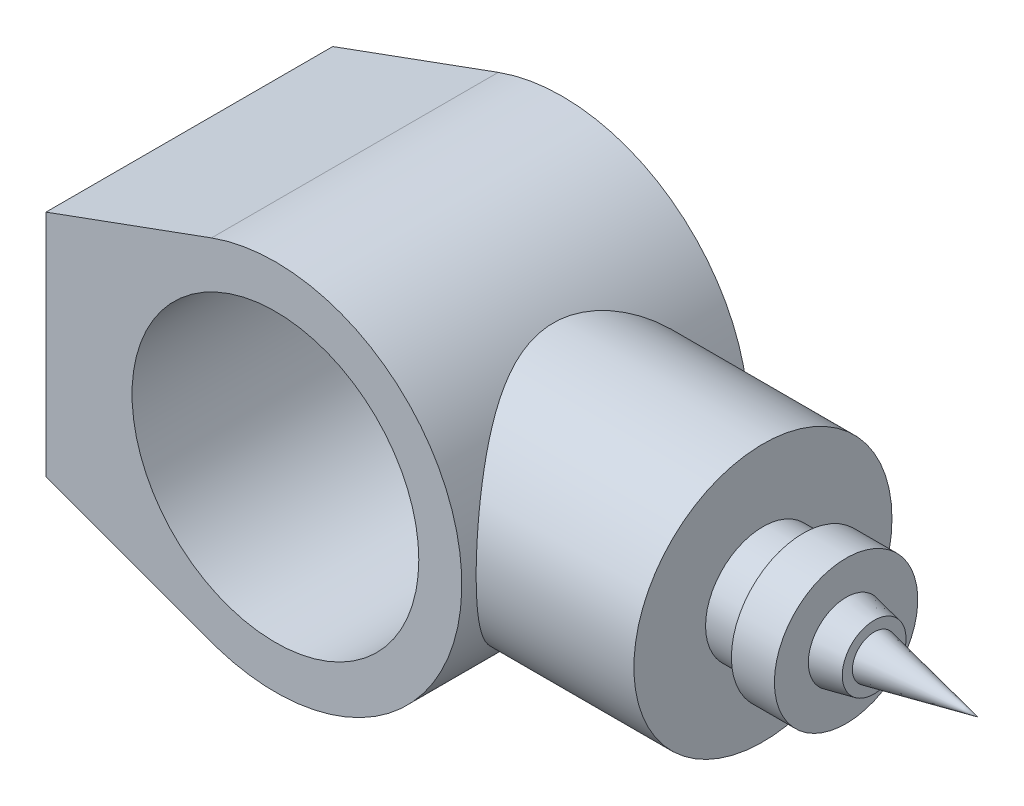
ISO-10303-21;
HEADER;
FILE_DESCRIPTION(('STEP AP214'),'2;1');
FILE_NAME('part.step','',(''),(''),'','','');
FILE_SCHEMA(('AUTOMOTIVE_DESIGN { 1 0 10303 214 1 1 1 1 }'));
ENDSEC;
DATA;
#1=APPLICATION_CONTEXT('core data for automotive mechanical design processes');
#2=APPLICATION_PROTOCOL_DEFINITION('international standard','automotive_design',2000,#1);
#3=PRODUCT_CONTEXT('',#1,'mechanical');
#4=PRODUCT('Part','Part','',(#3));
#5=PRODUCT_RELATED_PRODUCT_CATEGORY('part','',(#4));
#6=PRODUCT_DEFINITION_FORMATION('','',#4);
#7=PRODUCT_DEFINITION_CONTEXT('part definition',#1,'design');
#8=PRODUCT_DEFINITION('design','',#6,#7);
#9=PRODUCT_DEFINITION_SHAPE('','',#8);
#10=(LENGTH_UNIT() NAMED_UNIT(*) SI_UNIT(.MILLI.,.METRE.));
#11=(NAMED_UNIT(*) PLANE_ANGLE_UNIT() SI_UNIT($,.RADIAN.));
#12=(NAMED_UNIT(*) SI_UNIT($,.STERADIAN.) SOLID_ANGLE_UNIT());
#13=UNCERTAINTY_MEASURE_WITH_UNIT(LENGTH_MEASURE(1.E-05),#10,'distance_accuracy_value','');
#14=(GEOMETRIC_REPRESENTATION_CONTEXT(3) GLOBAL_UNCERTAINTY_ASSIGNED_CONTEXT((#13)) GLOBAL_UNIT_ASSIGNED_CONTEXT((#10,
#11,#12)) REPRESENTATION_CONTEXT('',''));
#15=CARTESIAN_POINT('',(0.,0.,0.));
#16=DIRECTION('',(0.,0.,1.));
#17=DIRECTION('',(1.,0.,0.));
#18=AXIS2_PLACEMENT_3D('',#15,#16,#17);
#19=CARTESIAN_POINT('',(0.,0.,50.));
#20=DIRECTION('',(0.,0.,-1.));
#21=DIRECTION('',(-1.,0.,0.));
#22=AXIS2_PLACEMENT_3D('',#19,#20,#21);
#23=CYLINDRICAL_SURFACE('',#22,65.);
#24=CARTESIAN_POINT('',(65.,0.,-45.));
#25=CARTESIAN_POINT('',(65.0000011696057,1.12147330120565,-45.0000012025283));
#26=CARTESIAN_POINT('',(64.9709159765212,2.24292945230778,-44.9580201602482));
#27=CARTESIAN_POINT('',(64.8553068641383,4.47658414079082,-44.790785609369));
#28=CARTESIAN_POINT('',(64.7687842573088,5.58878288911931,-44.6655340035371));
#29=CARTESIAN_POINT('',(64.5403785763001,7.79555151848628,-44.3336771879691));
#30=CARTESIAN_POINT('',(64.3984760503456,8.89011506447751,-44.1270433931238));
#31=CARTESIAN_POINT('',(64.0626457436966,11.0533096019768,-43.6354760134034));
#32=CARTESIAN_POINT('',(63.8687169569864,12.1219400915896,-43.3505409144375));
#33=CARTESIAN_POINT('',(63.4342222744662,14.2212125160505,-42.7078017297046));
#34=CARTESIAN_POINT('',(63.1938918545645,15.2520162370063,-42.3503651251477));
#35=CARTESIAN_POINT('',(62.6709259446924,17.2756280115286,-41.5659763086892));
#36=CARTESIAN_POINT('',(62.3882907364915,18.268436318107,-41.1390245597888));
#37=CARTESIAN_POINT('',(61.786108553932,20.2116697228795,-40.2199419970838));
#38=CARTESIAN_POINT('',(61.4665619062631,21.1620951960855,-39.7278117601444));
#39=CARTESIAN_POINT('',(60.7962171584065,23.0172309124314,-38.6825647509799));
#40=CARTESIAN_POINT('',(60.4454175300334,23.9219389167185,-38.1294449962195));
#41=CARTESIAN_POINT('',(59.6865648974474,25.7601880140228,-36.9151737617935));
#42=CARTESIAN_POINT('',(59.27618815402,26.6893215363404,-36.2488040005491));
#43=CARTESIAN_POINT('',(58.4330275057249,28.4880338622967,-34.8529502059224));
#44=CARTESIAN_POINT('',(58.0002425478181,29.3576098626539,-34.1234632053608));
#45=CARTESIAN_POINT('',(57.1195111836477,31.0364486388513,-32.6040251352403));
#46=CARTESIAN_POINT('',(56.6715447181891,31.8456267033451,-31.8139921794123));
#47=CARTESIAN_POINT('',(55.7691986061138,33.4006700551814,-30.1773036556993));
#48=CARTESIAN_POINT('',(55.3148185876119,34.1465316534289,-29.3306447936721));
#49=CARTESIAN_POINT('',(54.3303114345595,35.6959084068904,-27.4326466159468));
#50=CARTESIAN_POINT('',(53.8005937511269,36.4872853280241,-26.3711450656527));
#51=CARTESIAN_POINT('',(52.7593327891933,37.9773509509911,-24.17604025639));
#52=CARTESIAN_POINT('',(52.2477941160227,38.6760162868262,-23.0424189272517));
#53=CARTESIAN_POINT('',(51.2608149265043,39.9749077721744,-20.7072341856928));
#54=CARTESIAN_POINT('',(50.7853275075273,40.5752630453964,-19.5057627267967));
#55=CARTESIAN_POINT('',(49.8892399163793,41.6721166930025,-17.036931864064));
#56=CARTESIAN_POINT('',(49.4686114171658,42.1686687478853,-15.7696069409943));
#57=CARTESIAN_POINT('',(48.8208029416879,42.9149535309565,-13.5723996352816));
#58=CARTESIAN_POINT('',(48.5738420263557,43.1936925213245,-12.6581208440976));
#59=CARTESIAN_POINT('',(48.1238801744123,43.6944569649788,-10.8035389223551));
#60=CARTESIAN_POINT('',(47.9208721021929,43.9164916250901,-9.86324004407419));
#61=CARTESIAN_POINT('',(47.5660754926548,44.3005296261305,-7.96250438663409));
#62=CARTESIAN_POINT('',(47.4142038087044,44.4626304606427,-7.00210302149487));
#63=CARTESIAN_POINT('',(47.1671263845177,44.7246555122386,-5.06554052628518));
#64=CARTESIAN_POINT('',(47.0719206259529,44.824579749433,-4.08937940131224));
#65=CARTESIAN_POINT('',(46.9418899090943,44.9607388198673,-2.1232364847967));
#66=CARTESIAN_POINT('',(46.9073939345417,44.9966266570423,-1.13320851844658));
#67=CARTESIAN_POINT('',(46.9013571135476,45.0029190462422,0.847248377093852));
#68=CARTESIAN_POINT('',(46.9298161498631,44.9733237202183,1.837677305534));
#69=CARTESIAN_POINT('',(47.0484302849821,44.8492190899201,3.81128752429081));
#70=CARTESIAN_POINT('',(47.13862305521,44.7546701492421,4.79446401850661));
#71=CARTESIAN_POINT('',(47.3768313176079,44.5024241630868,6.74551496467455));
#72=CARTESIAN_POINT('',(47.5248480621437,44.3447257499009,7.71338908473168));
#73=CARTESIAN_POINT('',(47.8621764271841,43.9803320764262,9.56919366964684));
#74=CARTESIAN_POINT('',(48.0484149088864,43.7772163066585,10.4583970625519));
#75=CARTESIAN_POINT('',(48.4609441046406,43.32010640119,12.2144143492181));
#76=CARTESIAN_POINT('',(48.6872496045115,43.0660934784815,13.0812198417583));
#77=CARTESIAN_POINT('',(49.1738509640383,42.5096331932465,14.7898225666927));
#78=CARTESIAN_POINT('',(49.4341648638834,42.2071601049958,15.6316062329481));
#79=CARTESIAN_POINT('',(49.9825182796335,41.5563350032134,17.2876417419013));
#80=CARTESIAN_POINT('',(50.2705534011697,41.2079902580444,18.1018979206949));
#81=CARTESIAN_POINT('',(51.0225431471345,40.2767822129268,20.1137766396802));
#82=CARTESIAN_POINT('',(51.5007434523328,39.6654891440572,21.2930273345177));
#83=CARTESIAN_POINT('',(52.4891158781477,38.348029920852,23.5833678403921));
#84=CARTESIAN_POINT('',(52.9993005340589,37.6418264436726,24.6944305853524));
#85=CARTESIAN_POINT('',(54.0361557973494,36.1376496350166,26.8476775780095));
#86=CARTESIAN_POINT('',(54.5628535785461,35.3395185623559,27.8897384505711));
#87=CARTESIAN_POINT('',(55.6171804467178,33.6558443419671,29.8998791095632));
#88=CARTESIAN_POINT('',(56.1448094104418,32.7703120184234,30.8679680307498));
#89=CARTESIAN_POINT('',(57.1932449701135,30.9045304086319,32.7363921475659));
#90=CARTESIAN_POINT('',(57.7139191350983,29.9233731295192,33.6358963165067));
#91=CARTESIAN_POINT('',(58.7296419536465,27.8771206485979,35.350355349792));
#92=CARTESIAN_POINT('',(59.2246882700661,26.8120178135979,36.1653025097018));
#93=CARTESIAN_POINT('',(60.1756566955639,24.6035209522421,37.7024332048813));
#94=CARTESIAN_POINT('',(60.6316475651595,23.4602711709794,38.4247809320632));
#95=CARTESIAN_POINT('',(61.4931891608211,21.0989507187335,39.7703323765769));
#96=CARTESIAN_POINT('',(61.898755017873,19.8809026570889,40.3935658507715));
#97=CARTESIAN_POINT('',(62.5646802947783,17.6549035875762,41.4059204565395));
#98=CARTESIAN_POINT('',(62.8372982548467,16.6602403417733,41.8163120535009));
#99=CARTESIAN_POINT('',(63.3397164077328,14.6345031625144,42.5675669112335));
#100=CARTESIAN_POINT('',(63.569522535998,13.603434299959,42.9084398107234));
#101=CARTESIAN_POINT('',(63.9815049902596,11.5110112910016,43.5164676119118));
#102=CARTESIAN_POINT('',(64.1637052650743,10.4496726714621,43.7836595836378));
#103=CARTESIAN_POINT('',(64.476639865795,8.30296993183371,44.2409869387356));
#104=CARTESIAN_POINT('',(64.6073730982257,7.21760530180254,44.431120684921));
#105=CARTESIAN_POINT('',(64.8147345736682,5.02649787175023,44.7321113931983));
#106=CARTESIAN_POINT('',(64.8911534961694,3.92069290489763,44.8426616714377));
#107=CARTESIAN_POINT('',(64.9872183357685,1.70145350776208,44.981563734156));
#108=CARTESIAN_POINT('',(65.0068642771874,0.588019080747696,45.0099155538474));
#109=CARTESIAN_POINT('',(64.9889001241945,-1.63741781931566,44.9839662509349));
#110=CARTESIAN_POINT('',(64.9512898349751,-2.74942028747967,44.929664847113));
#111=CARTESIAN_POINT('',(64.819734418053,-4.96298947367603,44.7392747901952));
#112=CARTESIAN_POINT('',(64.7257910494465,-6.06455651648127,44.6031886909653));
#113=CARTESIAN_POINT('',(64.491175703309,-8.18254449212149,44.2620157992034));
#114=CARTESIAN_POINT('',(64.3536808680178,-9.20007959997774,44.0616107864454));
#115=CARTESIAN_POINT('',(64.0337856060908,-11.2121337136589,43.5930613516679));
#116=CARTESIAN_POINT('',(63.8513873855499,-12.2066538475799,43.3249202574929));
#117=CARTESIAN_POINT('',(63.4451725249075,-14.1673074608523,42.7239854011605));
#118=CARTESIAN_POINT('',(63.2213525684632,-15.1334386601223,42.3911864622047));
#119=CARTESIAN_POINT('',(62.736336352677,-17.0327019487273,41.6643868113868));
#120=CARTESIAN_POINT('',(62.4751380044848,-17.965832190203,41.2703826790343));
#121=CARTESIAN_POINT('',(61.8990085085122,-19.8637431772395,40.3931275129008));
#122=CARTESIAN_POINT('',(61.5815209528501,-20.8256806929253,39.9054081529014));
#123=CARTESIAN_POINT('',(60.9142086391395,-22.7035764997345,38.8677076181211));
#124=CARTESIAN_POINT('',(60.5643826081083,-23.6195329786528,38.3177239921568));
#125=CARTESIAN_POINT('',(59.8381347129401,-25.4032558353403,37.1592008079418));
#126=CARTESIAN_POINT('',(59.4616987975441,-26.270996314329,36.5506302507532));
#127=CARTESIAN_POINT('',(58.6884577670336,-27.9557544991496,35.2787474176625));
#128=CARTESIAN_POINT('',(58.2916515549571,-28.7727694681138,34.6154321925309));
#129=CARTESIAN_POINT('',(57.4151711853793,-30.4889708749912,33.1199200847161));
#130=CARTESIAN_POINT('',(56.9328754552547,-31.3785212006928,32.2781812569548));
#131=CARTESIAN_POINT('',(55.9590893109094,-33.0839042215169,30.5278352445589));
#132=CARTESIAN_POINT('',(55.4675975421249,-33.8997259516808,29.6192181500899));
#133=CARTESIAN_POINT('',(54.4860350387397,-35.45586994741,27.7375714933993));
#134=CARTESIAN_POINT('',(53.9959654596117,-36.1961418986443,26.7644997080007));
#135=CARTESIAN_POINT('',(53.0294834997435,-37.5978502361011,24.7568233036382));
#136=CARTESIAN_POINT('',(52.553069328415,-38.2592969946585,23.7222268074148));
#137=CARTESIAN_POINT('',(51.679941347726,-39.4291013564639,21.7149007388747));
#138=CARTESIAN_POINT('',(51.2803372484816,-39.9463152685162,20.7485884228094));
#139=CARTESIAN_POINT('',(50.5123974548912,-40.9130636661729,18.7705314851885));
#140=CARTESIAN_POINT('',(50.1440619804653,-41.3625976757848,17.7587865441704));
#141=CARTESIAN_POINT('',(49.4504928922364,-42.1893301292689,15.693797265063));
#142=CARTESIAN_POINT('',(49.1251906412473,-42.566644202947,14.6406225749502));
#143=CARTESIAN_POINT('',(48.5290098021012,-43.2451098617227,12.4950157035289));
#144=CARTESIAN_POINT('',(48.2581179989952,-43.5462799449171,11.4025931307277));
#145=CARTESIAN_POINT('',(47.8271610412375,-44.0186874861181,9.3921629994351));
#146=CARTESIAN_POINT('',(47.6558419905218,-44.2036946073207,8.47979353570419));
#147=CARTESIAN_POINT('',(47.3627606953031,-44.517583244497,6.63757582668245));
#148=CARTESIAN_POINT('',(47.2409923142224,-44.6464717105955,5.70772976070373));
#149=CARTESIAN_POINT('',(47.05166615705,-44.8459556683364,3.83718735816971));
#150=CARTESIAN_POINT('',(46.9840561376509,-44.9166073394187,2.89650236820514));
#151=CARTESIAN_POINT('',(46.9055698265682,-44.9985645522097,1.01014116515035));
#152=CARTESIAN_POINT('',(46.894694331428,-45.0098692606967,0.0644648821697862));
#153=CARTESIAN_POINT('',(46.9301408777119,-44.972908524549,-1.82506201386804));
#154=CARTESIAN_POINT('',(46.9764888551696,-44.9246160680299,-2.76891160474201));
#155=CARTESIAN_POINT('',(47.1245232303033,-44.7693052695385,-4.64731891289862));
#156=CARTESIAN_POINT('',(47.226209296244,-44.6622872796082,-5.58187668584874));
#157=CARTESIAN_POINT('',(47.4811423262629,-44.3911660407895,-7.43666598606561));
#158=CARTESIAN_POINT('',(47.634452919394,-44.2269923369625,-8.35687836049678));
#159=CARTESIAN_POINT('',(47.9871889035597,-43.8440109221367,-10.1768310643423));
#160=CARTESIAN_POINT('',(48.1866204648689,-43.6251959006593,-11.0765686368372));
#161=CARTESIAN_POINT('',(48.6908782922366,-43.0625185245671,-13.116726178063));
#162=CARTESIAN_POINT('',(49.0093972350599,-42.7008255731353,-14.2488681052183));
#163=CARTESIAN_POINT('',(49.699554494161,-41.8955268796886,-16.4668795226373));
#164=CARTESIAN_POINT('',(50.0712093704162,-41.4518955887103,-17.5527344499461));
#165=CARTESIAN_POINT('',(50.8544123719762,-40.4872212981013,-19.6760329984318));
#166=CARTESIAN_POINT('',(51.2660067549033,-39.9660881554129,-20.7134183727638));
#167=CARTESIAN_POINT('',(52.116211879306,-38.8508952329155,-22.7363587217865));
#168=CARTESIAN_POINT('',(52.5548209260535,-38.2568400254561,-23.7219169406072));
#169=CARTESIAN_POINT('',(53.4579357785502,-36.9847423381263,-25.6613286822633));
#170=CARTESIAN_POINT('',(53.9228021101371,-36.3051118639051,-26.6139712103077));
#171=CARTESIAN_POINT('',(54.8583333343946,-34.8753950985048,-28.4617532840731));
#172=CARTESIAN_POINT('',(55.3289982185488,-34.1253089107936,-29.3568929142368));
#173=CARTESIAN_POINT('',(56.2664339133503,-32.5564691651912,-31.0876310121466));
#174=CARTESIAN_POINT('',(56.7332035093429,-31.7376950080829,-31.923211478402));
#175=CARTESIAN_POINT('',(57.6535165855435,-30.033481652025,-33.5315189390535));
#176=CARTESIAN_POINT('',(58.1070588196762,-29.1480362003111,-34.3042400240121));
#177=CARTESIAN_POINT('',(59.0635284336244,-27.1643113596245,-35.9022819462667));
#178=CARTESIAN_POINT('',(59.5626106290919,-26.0547472869609,-36.7159606163356));
#179=CARTESIAN_POINT('',(60.5176757229357,-23.7521280348398,-38.2458641369291));
#180=CARTESIAN_POINT('',(60.9736519283074,-22.5590599397198,-38.962073861155));
#181=CARTESIAN_POINT('',(61.6149926579414,-20.7127348127311,-39.9558623322098));
#182=CARTESIAN_POINT('',(61.8215919655179,-20.088110583999,-40.2735888165198));
#183=CARTESIAN_POINT('',(62.2191547005856,-18.8206694867556,-40.8812436548858));
#184=CARTESIAN_POINT('',(62.4101203779565,-18.1778552539997,-41.1711760099034));
#185=CARTESIAN_POINT('',(62.7748527233683,-16.875283117665,-41.7219931318356));
#186=CARTESIAN_POINT('',(62.9486230408552,-16.2155288469421,-41.9828840638124));
#187=CARTESIAN_POINT('',(63.2775356475737,-14.8804011558233,-42.4744610119283));
#188=CARTESIAN_POINT('',(63.432679284421,-14.2050288695917,-42.7051492133046));
#189=CARTESIAN_POINT('',(63.8070721968101,-12.4447010544915,-43.25974494481));
#190=CARTESIAN_POINT('',(64.0114184468014,-11.3490405228654,-43.5602757498286));
#191=CARTESIAN_POINT('',(64.3654191982087,-9.12991345978806,-44.078827644396));
#192=CARTESIAN_POINT('',(64.5150820049425,-8.00645117856259,-44.2968612637911));
#193=CARTESIAN_POINT('',(64.7559993187061,-5.74082253729113,-44.6470112993716));
#194=CARTESIAN_POINT('',(64.847297757104,-4.59867091062173,-44.7791923387443));
#195=CARTESIAN_POINT('',(64.9692976296881,-2.30434018473195,-44.9556862638234));
#196=CARTESIAN_POINT('',(64.9999987983895,-1.15216104160189,-44.999998764566));
#197=CARTESIAN_POINT('',(65.,0.,-45.));
#198=B_SPLINE_CURVE_WITH_KNOTS('',3,(#24,#25,#26,#27,#28,#29,#30,#31,#32,#33,#34,#35,#36,#37,
#38,#39,#40,#41,#42,#43,#44,#45,#46,#47,#48,#49,#50,#51,#52,#53,#54,#55,#56,#57,#58,#59,#60,#61,
#62,#63,#64,#65,#66,#67,#68,#69,#70,#71,#72,#73,#74,#75,#76,#77,#78,#79,#80,#81,#82,#83,#84,#85,
#86,#87,#88,#89,#90,#91,#92,#93,#94,#95,#96,#97,#98,#99,#100,#101,#102,#103,#104,#105,#106,#107,
#108,#109,#110,#111,#112,#113,#114,#115,#116,#117,#118,#119,#120,#121,#122,#123,#124,#125,#126,
#127,#128,#129,#130,#131,#132,#133,#134,#135,#136,#137,#138,#139,#140,#141,#142,#143,#144,#145,
#146,#147,#148,#149,#150,#151,#152,#153,#154,#155,#156,#157,#158,#159,#160,#161,#162,#163,#164,
#165,#166,#167,#168,#169,#170,#171,#172,#173,#174,#175,#176,#177,#178,#179,#180,#181,#182,#183,
#184,#185,#186,#187,#188,#189,#190,#191,#192,#193,#194,#195,#196,#197),.UNSPECIFIED.,.T.,.F.,(4,
2,2,2,2,2,2,2,2,2,2,2,2,2,2,2,2,2,2,2,2,2,2,2,2,2,2,2,2,2,2,2,2,2,2,2,2,2,2,2,2,2,2,2,2,2,2,2,2,
2,2,2,2,2,2,2,2,2,2,2,2,2,2,2,2,2,2,2,2,2,2,2,2,2,2,2,2,2,2,2,2,2,2,2,2,2,4),(0.,
3.36323892794144,6.72640100710137,10.0907454360665,13.4551549250109,16.8029195613731,
20.1506619010729,23.4983746134034,26.8462511096753,30.4871649037346,34.1282499524345,
37.7743494260164,41.4206611917409,45.6939383064405,49.9682903731881,54.2369825353392,
58.5034617073671,61.4625138492405,64.4210852373372,67.3748225577202,70.3285589227263,
73.2982527376573,76.2679410220407,79.2394430998938,82.2110095388412,85.0011411726389,
87.7923045951578,90.584954683776,93.3771628083065,97.6064034875675,101.837312178738,
106.075592113262,110.313347816192,114.596218662803,118.879479402292,123.155037051935,
127.429308626693,130.755998382163,134.082226580387,137.406778235214,140.731400520075,
144.068767009318,147.406132068879,150.743508483461,154.080780688207,157.215791533369,
160.350648386749,163.485756334407,166.621039552604,169.990545063149,173.360183268584,
176.73161428665,180.103227050672,184.047902440152,187.993163521895,191.94103513809,
195.888386692538,199.385185586645,202.88200907258,206.373186157811,209.863514294626,
212.700365177753,215.536864625513,218.370624567028,221.204424293963,224.039508887241,
226.874576485218,229.713151272815,232.55210603787,236.23803941247,239.925124033801,
243.616531168718,247.307706963636,251.081871120678,254.856029735252,258.631324277359,
262.406973327354,266.792058434818,271.177823293658,273.368885604935,275.55963203795,
277.749912517597,279.940034437727,283.398420446896,286.856280978073,290.31153567335,
293.766805506531),.UNSPECIFIED.);
#199=CARTESIAN_POINT('',(65.,0.,-45.));
#200=VERTEX_POINT('',#199);
#201=EDGE_CURVE('E59',#200,#200,#198,.T.);
#202=ORIENTED_EDGE('',*,*,#201,.F.);
#203=EDGE_LOOP('',(#202));
#204=FACE_BOUND('',#203,.T.);
#205=ADVANCED_FACE('F54',(#204),#23,.F.);
#206=CARTESIAN_POINT('',(120.,0.,0.));
#207=DIRECTION('',(1.,0.,0.));
#208=DIRECTION('',(0.,0.,-1.));
#209=AXIS2_PLACEMENT_3D('',#206,#207,#208);
#210=PLANE('',#209);
#211=CARTESIAN_POINT('',(120.,0.,0.));
#212=DIRECTION('',(-1.,0.,0.));
#213=DIRECTION('',(0.,0.,1.));
#214=AXIS2_PLACEMENT_3D('',#211,#212,#213);
#215=CIRCLE('',#214,20.);
#216=CARTESIAN_POINT('',(120.,0.,20.));
#217=VERTEX_POINT('',#216);
#218=EDGE_CURVE('E94',#217,#217,#215,.T.);
#219=ORIENTED_EDGE('',*,*,#218,.T.);
#220=EDGE_LOOP('',(#219));
#221=FACE_BOUND('',#220,.T.);
#222=CARTESIAN_POINT('',(120.,0.,0.));
#223=DIRECTION('',(1.,0.,0.));
#224=DIRECTION('',(0.,0.,-1.));
#225=AXIS2_PLACEMENT_3D('',#222,#223,#224);
#226=CIRCLE('',#225,45.);
#227=CARTESIAN_POINT('',(120.,0.,-45.));
#228=VERTEX_POINT('',#227);
#229=EDGE_CURVE('E12',#228,#228,#226,.T.);
#230=ORIENTED_EDGE('',*,*,#229,.T.);
#231=EDGE_LOOP('',(#230));
#232=FACE_BOUND('',#231,.T.);
#233=ADVANCED_FACE('F103',(#221,#232),#210,.T.);
#234=CARTESIAN_POINT('',(-80.002,0.,0.));
#235=DIRECTION('',(1.,0.,0.));
#236=DIRECTION('',(0.,0.,-1.));
#237=AXIS2_PLACEMENT_3D('',#234,#235,#236);
#238=CYLINDRICAL_SURFACE('',#237,45.);
#239=ORIENTED_EDGE('',*,*,#229,.F.);
#240=EDGE_LOOP('',(#239));
#241=FACE_BOUND('',#240,.T.);
#242=ORIENTED_EDGE('',*,*,#201,.T.);
#243=EDGE_LOOP('',(#242));
#244=FACE_BOUND('',#243,.T.);
#245=ADVANCED_FACE('F56',(#241,#244),#238,.T.);
#246=CARTESIAN_POINT('',(0.,0.,0.));
#247=DIRECTION('',(-1.,0.,0.));
#248=DIRECTION('',(0.,0.,1.));
#249=AXIS2_PLACEMENT_3D('',#246,#247,#248);
#250=CYLINDRICAL_SURFACE('',#249,20.);
#251=CARTESIAN_POINT('',(134.,0.,0.));
#252=DIRECTION('',(-1.,0.,0.));
#253=DIRECTION('',(0.,0.,1.));
#254=AXIS2_PLACEMENT_3D('',#251,#252,#253);
#255=CIRCLE('',#254,20.);
#256=CARTESIAN_POINT('',(134.,0.,20.));
#257=VERTEX_POINT('',#256);
#258=EDGE_CURVE('E91',#257,#257,#255,.T.);
#259=ORIENTED_EDGE('',*,*,#258,.T.);
#260=EDGE_LOOP('',(#259));
#261=FACE_BOUND('',#260,.T.);
#262=ORIENTED_EDGE('',*,*,#218,.F.);
#263=EDGE_LOOP('',(#262));
#264=FACE_BOUND('',#263,.T.);
#265=ADVANCED_FACE('F110',(#261,#264),#250,.T.);
#266=CARTESIAN_POINT('',(134.,-20.,0.));
#267=DIRECTION('',(-1.,0.,0.));
#268=DIRECTION('',(0.,0.,1.));
#269=AXIS2_PLACEMENT_3D('',#266,#267,#268);
#270=PLANE('',#269);
#271=CARTESIAN_POINT('',(134.,0.,0.));
#272=DIRECTION('',(-1.,0.,0.));
#273=DIRECTION('',(0.,0.,1.));
#274=AXIS2_PLACEMENT_3D('',#271,#272,#273);
#275=CIRCLE('',#274,25.);
#276=CARTESIAN_POINT('',(134.,0.,25.));
#277=VERTEX_POINT('',#276);
#278=EDGE_CURVE('E88',#277,#277,#275,.T.);
#279=ORIENTED_EDGE('',*,*,#278,.T.);
#280=EDGE_LOOP('',(#279));
#281=FACE_BOUND('',#280,.T.);
#282=ORIENTED_EDGE('',*,*,#258,.F.);
#283=EDGE_LOOP('',(#282));
#284=FACE_BOUND('',#283,.T.);
#285=ADVANCED_FACE('F113',(#281,#284),#270,.T.);
#286=CARTESIAN_POINT('',(0.,0.,0.));
#287=DIRECTION('',(-1.,0.,0.));
#288=DIRECTION('',(0.,0.,1.));
#289=AXIS2_PLACEMENT_3D('',#286,#287,#288);
#290=CYLINDRICAL_SURFACE('',#289,25.);
#291=CARTESIAN_POINT('',(149.,0.,0.));
#292=DIRECTION('',(-1.,0.,0.));
#293=DIRECTION('',(0.,0.,1.));
#294=AXIS2_PLACEMENT_3D('',#291,#292,#293);
#295=CIRCLE('',#294,25.);
#296=CARTESIAN_POINT('',(149.,0.,25.));
#297=VERTEX_POINT('',#296);
#298=EDGE_CURVE('E85',#297,#297,#295,.T.);
#299=ORIENTED_EDGE('',*,*,#298,.T.);
#300=EDGE_LOOP('',(#299));
#301=FACE_BOUND('',#300,.T.);
#302=ORIENTED_EDGE('',*,*,#278,.F.);
#303=EDGE_LOOP('',(#302));
#304=FACE_BOUND('',#303,.T.);
#305=ADVANCED_FACE('F117',(#301,#304),#290,.T.);
#306=CARTESIAN_POINT('',(149.,-25.,0.));
#307=DIRECTION('',(1.,0.,0.));
#308=DIRECTION('',(0.,0.,-1.));
#309=AXIS2_PLACEMENT_3D('',#306,#307,#308);
#310=PLANE('',#309);
#311=CARTESIAN_POINT('',(149.,0.,0.));
#312=DIRECTION('',(-1.,0.,0.));
#313=DIRECTION('',(0.,0.,1.));
#314=AXIS2_PLACEMENT_3D('',#311,#312,#313);
#315=CIRCLE('',#314,13.1713836350693);
#316=CARTESIAN_POINT('',(149.,0.,13.1713836350693));
#317=VERTEX_POINT('',#316);
#318=EDGE_CURVE('E80',#317,#317,#315,.T.);
#319=ORIENTED_EDGE('',*,*,#318,.T.);
#320=EDGE_LOOP('',(#319));
#321=FACE_BOUND('',#320,.T.);
#322=ORIENTED_EDGE('',*,*,#298,.F.);
#323=EDGE_LOOP('',(#322));
#324=FACE_BOUND('',#323,.T.);
#325=ADVANCED_FACE('F121',(#321,#324),#310,.T.);
#326=CARTESIAN_POINT('',(149.,0.,0.));
#327=DIRECTION('',(-1.,0.,0.));
#328=DIRECTION('',(0.,0.,1.));
#329=AXIS2_PLACEMENT_3D('',#326,#327,#328);
#330=CONICAL_SURFACE('',#329,13.1713836350693,0.206651763576632);
#331=CARTESIAN_POINT('',(158.787234042553,0.,0.));
#332=DIRECTION('',(-1.,0.,0.));
#333=DIRECTION('',(0.,0.,1.));
#334=AXIS2_PLACEMENT_3D('',#331,#332,#333);
#335=CIRCLE('',#334,11.1195430476239);
#336=CARTESIAN_POINT('',(158.787234042553,0.,11.1195430476239));
#337=VERTEX_POINT('',#336);
#338=EDGE_CURVE('E77',#337,#337,#335,.T.);
#339=ORIENTED_EDGE('',*,*,#338,.T.);
#340=EDGE_LOOP('',(#339));
#341=FACE_BOUND('',#340,.T.);
#342=ORIENTED_EDGE('',*,*,#318,.F.);
#343=EDGE_LOOP('',(#342));
#344=FACE_BOUND('',#343,.T.);
#345=ADVANCED_FACE('F125',(#341,#344),#330,.T.);
#346=CARTESIAN_POINT('',(158.787234042553,-11.1195430476239,0.));
#347=DIRECTION('',(1.,0.,0.));
#348=DIRECTION('',(0.,0.,-1.));
#349=AXIS2_PLACEMENT_3D('',#346,#347,#348);
#350=PLANE('',#349);
#351=CARTESIAN_POINT('',(158.787234042553,0.,0.));
#352=DIRECTION('',(-1.,0.,0.));
#353=DIRECTION('',(0.,0.,1.));
#354=AXIS2_PLACEMENT_3D('',#351,#352,#353);
#355=CIRCLE('',#354,7.59181017354779);
#356=CARTESIAN_POINT('',(158.787234042553,0.,7.59181017354779));
#357=VERTEX_POINT('',#356);
#358=EDGE_CURVE('E75',#357,#357,#355,.T.);
#359=ORIENTED_EDGE('',*,*,#358,.T.);
#360=EDGE_LOOP('',(#359));
#361=FACE_BOUND('',#360,.T.);
#362=ORIENTED_EDGE('',*,*,#338,.F.);
#363=EDGE_LOOP('',(#362));
#364=FACE_BOUND('',#363,.T.);
#365=ADVANCED_FACE('F71',(#361,#364),#350,.T.);
#366=CARTESIAN_POINT('',(158.787234042553,0.,0.));
#367=DIRECTION('',(-1.,0.,0.));
#368=DIRECTION('',(0.,0.,1.));
#369=AXIS2_PLACEMENT_3D('',#366,#367,#368);
#370=CONICAL_SURFACE('',#369,7.59181017354779,0.206651763576632);
#371=CARTESIAN_POINT('',(195.,0.,0.));
#372=VERTEX_POINT('',#371);
#373=VERTEX_LOOP('',#372);
#374=FACE_BOUND('',#373,.T.);
#375=ORIENTED_EDGE('',*,*,#358,.F.);
#376=EDGE_LOOP('',(#375));
#377=FACE_BOUND('',#376,.T.);
#378=ADVANCED_FACE('F68',(#374,#377),#370,.T.);
#379=CLOSED_SHELL('',(#205,#233,#245,#265,#285,#305,#325,#345,#365,#378));
#380=MANIFOLD_SOLID_BREP('B2',#379);
#381=CARTESIAN_POINT('',(0.,0.,50.));
#382=DIRECTION('',(0.,0.,1.));
#383=DIRECTION('',(1.,0.,0.));
#384=AXIS2_PLACEMENT_3D('',#381,#382,#383);
#385=PLANE('',#384);
#386=CARTESIAN_POINT('',(0.,0.,50.));
#387=DIRECTION('',(0.,0.,1.));
#388=DIRECTION('',(1.,0.,0.));
#389=AXIS2_PLACEMENT_3D('',#386,#387,#388);
#390=CIRCLE('',#389,65.);
#391=CARTESIAN_POINT('',(-20.5102120004301,-61.6792607259313,50.));
#392=VERTEX_POINT('',#391);
#393=CARTESIAN_POINT('',(-22.2816656929027,61.0616686141946,50.));
#394=VERTEX_POINT('',#393);
#395=EDGE_CURVE('E294',#392,#394,#390,.T.);
#396=ORIENTED_EDGE('',*,*,#395,.T.);
#397=DIRECTION('',(-0.939410286372225,-0.342794856813887,0.));
#398=VECTOR('',#397,1.);
#399=CARTESIAN_POINT('',(-80.,40.,50.));
#400=LINE('',#399,#398);
#401=CARTESIAN_POINT('',(-80.,40.,50.));
#402=VERTEX_POINT('',#401);
#403=EDGE_CURVE('E289',#394,#402,#400,.T.);
#404=ORIENTED_EDGE('',*,*,#403,.T.);
#405=DIRECTION('',(0.,-1.,0.));
#406=VECTOR('',#405,1.);
#407=CARTESIAN_POINT('',(-80.,-40.,50.));
#408=LINE('',#407,#406);
#409=CARTESIAN_POINT('',(-80.,-40.,50.));
#410=VERTEX_POINT('',#409);
#411=EDGE_CURVE('E292',#402,#410,#408,.T.);
#412=ORIENTED_EDGE('',*,*,#411,.T.);
#413=DIRECTION('',(0.939556771683848,-0.342393155280629,0.));
#414=VECTOR('',#413,1.);
#415=CARTESIAN_POINT('',(-80.,-40.,50.));
#416=LINE('',#415,#414);
#417=EDGE_CURVE('E259',#410,#392,#416,.T.);
#418=ORIENTED_EDGE('',*,*,#417,.T.);
#419=EDGE_LOOP('',(#396,#404,#412,#418));
#420=FACE_BOUND('',#419,.T.);
#421=CARTESIAN_POINT('',(0.,0.,50.));
#422=DIRECTION('',(0.,0.,1.));
#423=DIRECTION('',(1.,0.,0.));
#424=AXIS2_PLACEMENT_3D('',#421,#422,#423);
#425=CIRCLE('',#424,50.);
#426=CARTESIAN_POINT('',(50.,0.,50.));
#427=VERTEX_POINT('',#426);
#428=EDGE_CURVE('E309',#427,#427,#425,.T.);
#429=ORIENTED_EDGE('',*,*,#428,.F.);
#430=EDGE_LOOP('',(#429));
#431=FACE_BOUND('',#430,.T.);
#432=ADVANCED_FACE('F242',(#420,#431),#385,.T.);
#433=CARTESIAN_POINT('',(0.,0.,-50.));
#434=DIRECTION('',(0.,0.,1.));
#435=DIRECTION('',(1.,0.,0.));
#436=AXIS2_PLACEMENT_3D('',#433,#434,#435);
#437=PLANE('',#436);
#438=CARTESIAN_POINT('',(0.,0.,-50.));
#439=DIRECTION('',(0.,0.,1.));
#440=DIRECTION('',(1.,0.,0.));
#441=AXIS2_PLACEMENT_3D('',#438,#439,#440);
#442=CIRCLE('',#441,65.);
#443=CARTESIAN_POINT('',(-20.5102120004301,-61.6792607259313,-50.));
#444=VERTEX_POINT('',#443);
#445=CARTESIAN_POINT('',(-22.2816656929027,61.0616686141946,-50.));
#446=VERTEX_POINT('',#445);
#447=EDGE_CURVE('E306',#444,#446,#442,.T.);
#448=ORIENTED_EDGE('',*,*,#447,.F.);
#449=DIRECTION('',(0.939556771683848,-0.342393155280629,0.));
#450=VECTOR('',#449,1.);
#451=CARTESIAN_POINT('',(-80.,-40.,-50.));
#452=LINE('',#451,#450);
#453=CARTESIAN_POINT('',(-80.,-40.,-50.));
#454=VERTEX_POINT('',#453);
#455=EDGE_CURVE('E282',#454,#444,#452,.T.);
#456=ORIENTED_EDGE('',*,*,#455,.F.);
#457=DIRECTION('',(0.,-1.,0.));
#458=VECTOR('',#457,1.);
#459=CARTESIAN_POINT('',(-80.,-40.,-50.));
#460=LINE('',#459,#458);
#461=CARTESIAN_POINT('',(-80.,40.,-50.));
#462=VERTEX_POINT('',#461);
#463=EDGE_CURVE('E276',#462,#454,#460,.T.);
#464=ORIENTED_EDGE('',*,*,#463,.F.);
#465=DIRECTION('',(-0.939410286372225,-0.342794856813887,0.));
#466=VECTOR('',#465,1.);
#467=CARTESIAN_POINT('',(-80.,40.,-50.));
#468=LINE('',#467,#466);
#469=EDGE_CURVE('E298',#446,#462,#468,.T.);
#470=ORIENTED_EDGE('',*,*,#469,.F.);
#471=EDGE_LOOP('',(#448,#456,#464,#470));
#472=FACE_BOUND('',#471,.T.);
#473=CARTESIAN_POINT('',(0.,0.,-50.));
#474=DIRECTION('',(0.,0.,1.));
#475=DIRECTION('',(1.,0.,0.));
#476=AXIS2_PLACEMENT_3D('',#473,#474,#475);
#477=CIRCLE('',#476,50.);
#478=CARTESIAN_POINT('',(50.,0.,-50.));
#479=VERTEX_POINT('',#478);
#480=EDGE_CURVE('E321',#479,#479,#477,.T.);
#481=ORIENTED_EDGE('',*,*,#480,.T.);
#482=EDGE_LOOP('',(#481));
#483=FACE_BOUND('',#482,.T.);
#484=ADVANCED_FACE('F317',(#472,#483),#437,.F.);
#485=CARTESIAN_POINT('',(0.,0.,50.));
#486=DIRECTION('',(0.,0.,-1.));
#487=DIRECTION('',(-1.,0.,0.));
#488=AXIS2_PLACEMENT_3D('',#485,#486,#487);
#489=CYLINDRICAL_SURFACE('',#488,65.);
#490=ORIENTED_EDGE('',*,*,#447,.T.);
#491=DIRECTION('',(0.,0.,-1.));
#492=VECTOR('',#491,1.);
#493=CARTESIAN_POINT('',(-22.2816656929027,61.0616686141946,50.));
#494=LINE('',#493,#492);
#495=EDGE_CURVE('E52',#394,#446,#494,.T.);
#496=ORIENTED_EDGE('',*,*,#495,.F.);
#497=ORIENTED_EDGE('',*,*,#395,.F.);
#498=DIRECTION('',(0.,0.,-1.));
#499=VECTOR('',#498,1.);
#500=CARTESIAN_POINT('',(-20.5102120004301,-61.6792607259313,50.));
#501=LINE('',#500,#499);
#502=EDGE_CURVE('E302',#392,#444,#501,.T.);
#503=ORIENTED_EDGE('',*,*,#502,.T.);
#504=EDGE_LOOP('',(#490,#496,#497,#503));
#505=FACE_BOUND('',#504,.T.);
#506=ADVANCED_FACE('F244',(#505),#489,.T.);
#507=CARTESIAN_POINT('',(-80.,40.,50.));
#508=DIRECTION('',(0.342794856813887,-0.939410286372225,0.));
#509=DIRECTION('',(0.939410286372225,0.342794856813887,0.));
#510=AXIS2_PLACEMENT_3D('',#507,#508,#509);
#511=PLANE('',#510);
#512=ORIENTED_EDGE('',*,*,#469,.T.);
#513=DIRECTION('',(0.,0.,-1.));
#514=VECTOR('',#513,1.);
#515=CARTESIAN_POINT('',(-80.,40.,50.));
#516=LINE('',#515,#514);
#517=EDGE_CURVE('E251',#402,#462,#516,.T.);
#518=ORIENTED_EDGE('',*,*,#517,.F.);
#519=ORIENTED_EDGE('',*,*,#403,.F.);
#520=ORIENTED_EDGE('',*,*,#495,.T.);
#521=EDGE_LOOP('',(#512,#518,#519,#520));
#522=FACE_BOUND('',#521,.T.);
#523=ADVANCED_FACE('F297',(#522),#511,.F.);
#524=CARTESIAN_POINT('',(-80.,-40.,50.));
#525=DIRECTION('',(1.,0.,0.));
#526=DIRECTION('',(0.,0.,-1.));
#527=AXIS2_PLACEMENT_3D('',#524,#525,#526);
#528=PLANE('',#527);
#529=ORIENTED_EDGE('',*,*,#463,.T.);
#530=DIRECTION('',(0.,0.,-1.));
#531=VECTOR('',#530,1.);
#532=CARTESIAN_POINT('',(-80.,-40.,50.));
#533=LINE('',#532,#531);
#534=EDGE_CURVE('E299',#410,#454,#533,.T.);
#535=ORIENTED_EDGE('',*,*,#534,.F.);
#536=ORIENTED_EDGE('',*,*,#411,.F.);
#537=ORIENTED_EDGE('',*,*,#517,.T.);
#538=EDGE_LOOP('',(#529,#535,#536,#537));
#539=FACE_BOUND('',#538,.T.);
#540=ADVANCED_FACE('F300',(#539),#528,.F.);
#541=CARTESIAN_POINT('',(-80.,-40.,50.));
#542=DIRECTION('',(0.342393155280629,0.939556771683848,0.));
#543=DIRECTION('',(-0.939556771683848,0.342393155280629,0.));
#544=AXIS2_PLACEMENT_3D('',#541,#542,#543);
#545=PLANE('',#544);
#546=ORIENTED_EDGE('',*,*,#455,.T.);
#547=ORIENTED_EDGE('',*,*,#502,.F.);
#548=ORIENTED_EDGE('',*,*,#417,.F.);
#549=ORIENTED_EDGE('',*,*,#534,.T.);
#550=EDGE_LOOP('',(#546,#547,#548,#549));
#551=FACE_BOUND('',#550,.T.);
#552=ADVANCED_FACE('F314',(#551),#545,.F.);
#553=CARTESIAN_POINT('',(0.,0.,50.));
#554=DIRECTION('',(0.,0.,-1.));
#555=DIRECTION('',(-1.,0.,0.));
#556=AXIS2_PLACEMENT_3D('',#553,#554,#555);
#557=CYLINDRICAL_SURFACE('',#556,50.);
#558=ORIENTED_EDGE('',*,*,#428,.T.);
#559=EDGE_LOOP('',(#558));
#560=FACE_BOUND('',#559,.T.);
#561=ORIENTED_EDGE('',*,*,#480,.F.);
#562=EDGE_LOOP('',(#561));
#563=FACE_BOUND('',#562,.T.);
#564=ADVANCED_FACE('F327',(#560,#563),#557,.F.);
#565=CLOSED_SHELL('',(#432,#484,#506,#523,#540,#552,#564));
#566=MANIFOLD_SOLID_BREP('B6',#565);
#567=ADVANCED_BREP_SHAPE_REPRESENTATION('',(#18,#380,#566),#14);
#568=SHAPE_DEFINITION_REPRESENTATION(#9,#567);
ENDSEC;
END-ISO-10303-21;
